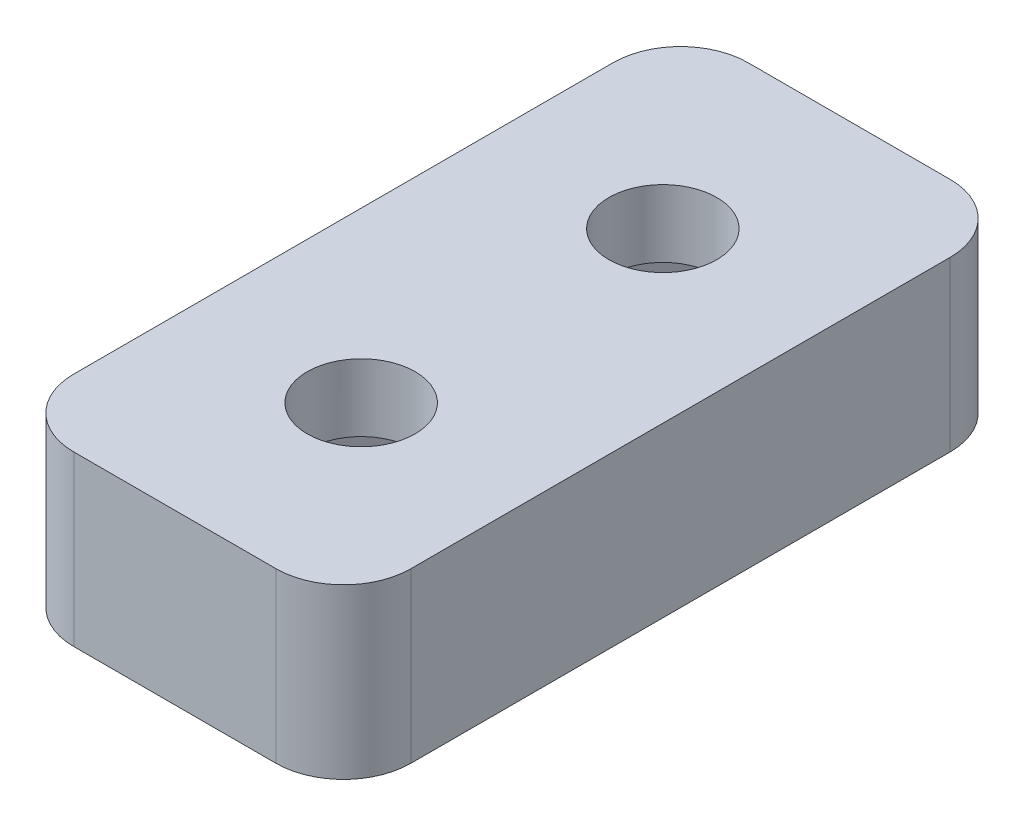
ISO-10303-21;
HEADER;
FILE_DESCRIPTION(('STEP AP214'),'2;1');
FILE_NAME('part.step','',(''),(''),'','','');
FILE_SCHEMA(('AUTOMOTIVE_DESIGN { 1 0 10303 214 1 1 1 1 }'));
ENDSEC;
DATA;
#1=APPLICATION_CONTEXT('core data for automotive mechanical design processes');
#2=APPLICATION_PROTOCOL_DEFINITION('international standard','automotive_design',2000,#1);
#3=PRODUCT_CONTEXT('',#1,'mechanical');
#4=PRODUCT('Part','Part','',(#3));
#5=PRODUCT_RELATED_PRODUCT_CATEGORY('part','',(#4));
#6=PRODUCT_DEFINITION_FORMATION('','',#4);
#7=PRODUCT_DEFINITION_CONTEXT('part definition',#1,'design');
#8=PRODUCT_DEFINITION('design','',#6,#7);
#9=PRODUCT_DEFINITION_SHAPE('','',#8);
#10=(LENGTH_UNIT() NAMED_UNIT(*) SI_UNIT(.MILLI.,.METRE.));
#11=(NAMED_UNIT(*) PLANE_ANGLE_UNIT() SI_UNIT($,.RADIAN.));
#12=(NAMED_UNIT(*) SI_UNIT($,.STERADIAN.) SOLID_ANGLE_UNIT());
#13=UNCERTAINTY_MEASURE_WITH_UNIT(LENGTH_MEASURE(1.E-05),#10,'distance_accuracy_value','');
#14=(GEOMETRIC_REPRESENTATION_CONTEXT(3) GLOBAL_UNCERTAINTY_ASSIGNED_CONTEXT((#13)) GLOBAL_UNIT_ASSIGNED_CONTEXT((#10,
#11,#12)) REPRESENTATION_CONTEXT('',''));
#15=CARTESIAN_POINT('',(0.,0.,0.));
#16=DIRECTION('',(0.,0.,1.));
#17=DIRECTION('',(1.,0.,0.));
#18=AXIS2_PLACEMENT_3D('',#15,#16,#17);
#19=CARTESIAN_POINT('',(0.,5.,4.47448218072288));
#20=DIRECTION('',(0.,-1.,0.));
#21=DIRECTION('',(0.,0.,-1.));
#22=AXIS2_PLACEMENT_3D('',#19,#20,#21);
#23=CYLINDRICAL_SURFACE('',#22,1.6);
#24=CARTESIAN_POINT('',(0.,5.,4.47448218072288));
#25=DIRECTION('',(0.,1.,0.));
#26=DIRECTION('',(0.,0.,1.));
#27=AXIS2_PLACEMENT_3D('',#24,#25,#26);
#28=CIRCLE('',#27,1.6);
#29=CARTESIAN_POINT('',(0.,5.,6.07448218072288));
#30=VERTEX_POINT('',#29);
#31=EDGE_CURVE('E278',#30,#30,#28,.T.);
#32=ORIENTED_EDGE('',*,*,#31,.T.);
#33=EDGE_LOOP('',(#32));
#34=FACE_BOUND('',#33,.T.);
#35=CARTESIAN_POINT('',(0.,3.,4.47448218072288));
#36=DIRECTION('',(0.,-1.,0.));
#37=DIRECTION('',(0.,0.,-1.));
#38=AXIS2_PLACEMENT_3D('',#35,#36,#37);
#39=CIRCLE('',#38,1.6);
#40=CARTESIAN_POINT('',(0.,3.,2.87448218072288));
#41=VERTEX_POINT('',#40);
#42=EDGE_CURVE('E223',#41,#41,#39,.T.);
#43=ORIENTED_EDGE('',*,*,#42,.T.);
#44=EDGE_LOOP('',(#43));
#45=FACE_BOUND('',#44,.T.);
#46=ADVANCED_FACE('F33',(#34,#45),#23,.F.);
#47=CARTESIAN_POINT('',(0.,5.,0.));
#48=DIRECTION('',(0.,-1.,0.));
#49=DIRECTION('',(0.,0.,-1.));
#50=AXIS2_PLACEMENT_3D('',#47,#48,#49);
#51=PLANE('',#50);
#52=DIRECTION('',(0.,0.,1.));
#53=VECTOR('',#52,1.);
#54=CARTESIAN_POINT('',(-5.,5.,10.));
#55=LINE('',#54,#53);
#56=CARTESIAN_POINT('',(-5.,5.,-8.));
#57=VERTEX_POINT('',#56);
#58=CARTESIAN_POINT('',(-5.,5.,8.));
#59=VERTEX_POINT('',#58);
#60=EDGE_CURVE('E291',#57,#59,#55,.T.);
#61=ORIENTED_EDGE('',*,*,#60,.T.);
#62=CARTESIAN_POINT('',(-3.,5.,8.));
#63=DIRECTION('',(0.,-1.,0.));
#64=DIRECTION('',(0.,0.,-1.));
#65=AXIS2_PLACEMENT_3D('',#62,#63,#64);
#66=CIRCLE('',#65,2.);
#67=CARTESIAN_POINT('',(-3.,5.,10.));
#68=VERTEX_POINT('',#67);
#69=EDGE_CURVE('E333',#59,#68,#66,.F.);
#70=ORIENTED_EDGE('',*,*,#69,.T.);
#71=DIRECTION('',(1.,0.,0.));
#72=VECTOR('',#71,1.);
#73=CARTESIAN_POINT('',(-5.,5.,10.));
#74=LINE('',#73,#72);
#75=CARTESIAN_POINT('',(3.,5.,10.));
#76=VERTEX_POINT('',#75);
#77=EDGE_CURVE('E294',#68,#76,#74,.T.);
#78=ORIENTED_EDGE('',*,*,#77,.T.);
#79=CARTESIAN_POINT('',(3.,5.,8.));
#80=DIRECTION('',(0.,-1.,0.));
#81=DIRECTION('',(0.,0.,-1.));
#82=AXIS2_PLACEMENT_3D('',#79,#80,#81);
#83=CIRCLE('',#82,2.);
#84=CARTESIAN_POINT('',(5.,5.,8.));
#85=VERTEX_POINT('',#84);
#86=EDGE_CURVE('E331',#76,#85,#83,.F.);
#87=ORIENTED_EDGE('',*,*,#86,.T.);
#88=DIRECTION('',(0.,0.,-1.));
#89=VECTOR('',#88,1.);
#90=CARTESIAN_POINT('',(5.,5.,10.));
#91=LINE('',#90,#89);
#92=CARTESIAN_POINT('',(5.,5.,-8.));
#93=VERTEX_POINT('',#92);
#94=EDGE_CURVE('E286',#85,#93,#91,.T.);
#95=ORIENTED_EDGE('',*,*,#94,.T.);
#96=CARTESIAN_POINT('',(3.,5.,-8.));
#97=DIRECTION('',(0.,-1.,0.));
#98=DIRECTION('',(0.,0.,-1.));
#99=AXIS2_PLACEMENT_3D('',#96,#97,#98);
#100=CIRCLE('',#99,2.);
#101=CARTESIAN_POINT('',(3.,5.,-10.));
#102=VERTEX_POINT('',#101);
#103=EDGE_CURVE('E54',#93,#102,#100,.F.);
#104=ORIENTED_EDGE('',*,*,#103,.T.);
#105=DIRECTION('',(-1.,0.,0.));
#106=VECTOR('',#105,1.);
#107=CARTESIAN_POINT('',(-5.,5.,-10.));
#108=LINE('',#107,#106);
#109=CARTESIAN_POINT('',(-3.,5.,-10.));
#110=VERTEX_POINT('',#109);
#111=EDGE_CURVE('E288',#102,#110,#108,.T.);
#112=ORIENTED_EDGE('',*,*,#111,.T.);
#113=CARTESIAN_POINT('',(-3.,5.,-8.));
#114=DIRECTION('',(0.,-1.,0.));
#115=DIRECTION('',(0.,0.,-1.));
#116=AXIS2_PLACEMENT_3D('',#113,#114,#115);
#117=CIRCLE('',#116,2.);
#118=EDGE_CURVE('E328',#110,#57,#117,.F.);
#119=ORIENTED_EDGE('',*,*,#118,.T.);
#120=EDGE_LOOP('',(#61,#70,#78,#87,#95,#104,#112,#119));
#121=FACE_BOUND('',#120,.T.);
#122=CARTESIAN_POINT('',(0.,5.,-4.47448218072288));
#123=DIRECTION('',(0.,1.,0.));
#124=DIRECTION('',(0.,0.,1.));
#125=AXIS2_PLACEMENT_3D('',#122,#123,#124);
#126=CIRCLE('',#125,1.6);
#127=CARTESIAN_POINT('',(0.,5.,-2.87448218072288));
#128=VERTEX_POINT('',#127);
#129=EDGE_CURVE('E281',#128,#128,#126,.T.);
#130=ORIENTED_EDGE('',*,*,#129,.F.);
#131=EDGE_LOOP('',(#130));
#132=FACE_BOUND('',#131,.T.);
#133=ORIENTED_EDGE('',*,*,#31,.F.);
#134=EDGE_LOOP('',(#133));
#135=FACE_BOUND('',#134,.T.);
#136=ADVANCED_FACE('F356',(#121,#132,#135),#51,.F.);
#137=CARTESIAN_POINT('',(0.,0.,0.));
#138=DIRECTION('',(0.,-1.,0.));
#139=DIRECTION('',(0.,0.,-1.));
#140=AXIS2_PLACEMENT_3D('',#137,#138,#139);
#141=PLANE('',#140);
#142=DIRECTION('',(0.5,0.,0.866025403784439));
#143=VECTOR('',#142,1.);
#144=CARTESIAN_POINT('',(1.61658075373095,0.,1.67448218072288));
#145=LINE('',#144,#143);
#146=CARTESIAN_POINT('',(1.61658075373095,0.,1.67448218072288));
#147=VERTEX_POINT('',#146);
#148=CARTESIAN_POINT('',(3.23316150746191,0.,4.47448218072288));
#149=VERTEX_POINT('',#148);
#150=EDGE_CURVE('E178',#147,#149,#145,.T.);
#151=ORIENTED_EDGE('',*,*,#150,.F.);
#152=DIRECTION('',(1.,0.,0.));
#153=VECTOR('',#152,1.);
#154=CARTESIAN_POINT('',(-1.61658075373095,0.,1.67448218072288));
#155=LINE('',#154,#153);
#156=CARTESIAN_POINT('',(-1.61658075373095,0.,1.67448218072288));
#157=VERTEX_POINT('',#156);
#158=EDGE_CURVE('E196',#157,#147,#155,.T.);
#159=ORIENTED_EDGE('',*,*,#158,.F.);
#160=DIRECTION('',(0.5,0.,-0.866025403784439));
#161=VECTOR('',#160,1.);
#162=CARTESIAN_POINT('',(-3.2331615074619,0.,4.47448218072288));
#163=LINE('',#162,#161);
#164=CARTESIAN_POINT('',(-3.2331615074619,0.,4.47448218072288));
#165=VERTEX_POINT('',#164);
#166=EDGE_CURVE('E199',#165,#157,#163,.T.);
#167=ORIENTED_EDGE('',*,*,#166,.F.);
#168=DIRECTION('',(-0.5,0.,-0.866025403784439));
#169=VECTOR('',#168,1.);
#170=CARTESIAN_POINT('',(-1.61658075373095,0.,7.27448218072289));
#171=LINE('',#170,#169);
#172=CARTESIAN_POINT('',(-1.61658075373095,0.,7.27448218072289));
#173=VERTEX_POINT('',#172);
#174=EDGE_CURVE('E216',#173,#165,#171,.T.);
#175=ORIENTED_EDGE('',*,*,#174,.F.);
#176=DIRECTION('',(-1.,0.,0.));
#177=VECTOR('',#176,1.);
#178=CARTESIAN_POINT('',(1.61658075373095,0.,7.27448218072289));
#179=LINE('',#178,#177);
#180=CARTESIAN_POINT('',(1.61658075373095,0.,7.27448218072289));
#181=VERTEX_POINT('',#180);
#182=EDGE_CURVE('E213',#181,#173,#179,.T.);
#183=ORIENTED_EDGE('',*,*,#182,.F.);
#184=DIRECTION('',(-0.5,0.,0.866025403784439));
#185=VECTOR('',#184,1.);
#186=CARTESIAN_POINT('',(3.23316150746191,0.,4.47448218072288));
#187=LINE('',#186,#185);
#188=EDGE_CURVE('E210',#149,#181,#187,.T.);
#189=ORIENTED_EDGE('',*,*,#188,.F.);
#190=EDGE_LOOP('',(#151,#159,#167,#175,#183,#189));
#191=FACE_BOUND('',#190,.T.);
#192=DIRECTION('',(-1.,0.,0.));
#193=VECTOR('',#192,1.);
#194=CARTESIAN_POINT('',(-1.61658075373095,0.,-1.67448218072288));
#195=LINE('',#194,#193);
#196=CARTESIAN_POINT('',(1.61658075373095,0.,-1.67448218072288));
#197=VERTEX_POINT('',#196);
#198=CARTESIAN_POINT('',(-1.61658075373095,0.,-1.67448218072288));
#199=VERTEX_POINT('',#198);
#200=EDGE_CURVE('E251',#197,#199,#195,.T.);
#201=ORIENTED_EDGE('',*,*,#200,.F.);
#202=DIRECTION('',(-0.5,0.,0.866025403784439));
#203=VECTOR('',#202,1.);
#204=CARTESIAN_POINT('',(1.61658075373095,0.,-1.67448218072288));
#205=LINE('',#204,#203);
#206=CARTESIAN_POINT('',(3.23316150746191,0.,-4.47448218072288));
#207=VERTEX_POINT('',#206);
#208=EDGE_CURVE('E235',#207,#197,#205,.T.);
#209=ORIENTED_EDGE('',*,*,#208,.F.);
#210=DIRECTION('',(0.5,0.,0.866025403784439));
#211=VECTOR('',#210,1.);
#212=CARTESIAN_POINT('',(3.23316150746191,0.,-4.47448218072288));
#213=LINE('',#212,#211);
#214=CARTESIAN_POINT('',(1.61658075373095,0.,-7.27448218072289));
#215=VERTEX_POINT('',#214);
#216=EDGE_CURVE('E262',#215,#207,#213,.T.);
#217=ORIENTED_EDGE('',*,*,#216,.F.);
#218=DIRECTION('',(1.,0.,0.));
#219=VECTOR('',#218,1.);
#220=CARTESIAN_POINT('',(1.61658075373095,0.,-7.27448218072289));
#221=LINE('',#220,#219);
#222=CARTESIAN_POINT('',(-1.61658075373095,0.,-7.27448218072289));
#223=VERTEX_POINT('',#222);
#224=EDGE_CURVE('E259',#223,#215,#221,.T.);
#225=ORIENTED_EDGE('',*,*,#224,.F.);
#226=DIRECTION('',(0.5,0.,-0.866025403784439));
#227=VECTOR('',#226,1.);
#228=CARTESIAN_POINT('',(-1.61658075373095,0.,-7.27448218072289));
#229=LINE('',#228,#227);
#230=CARTESIAN_POINT('',(-3.2331615074619,0.,-4.47448218072288));
#231=VERTEX_POINT('',#230);
#232=EDGE_CURVE('E256',#231,#223,#229,.T.);
#233=ORIENTED_EDGE('',*,*,#232,.F.);
#234=DIRECTION('',(-0.5,0.,-0.866025403784439));
#235=VECTOR('',#234,1.);
#236=CARTESIAN_POINT('',(-3.2331615074619,0.,-4.47448218072288));
#237=LINE('',#236,#235);
#238=EDGE_CURVE('E253',#199,#231,#237,.T.);
#239=ORIENTED_EDGE('',*,*,#238,.F.);
#240=EDGE_LOOP('',(#201,#209,#217,#225,#233,#239));
#241=FACE_BOUND('',#240,.T.);
#242=DIRECTION('',(1.,0.,0.));
#243=VECTOR('',#242,1.);
#244=CARTESIAN_POINT('',(-5.,0.,10.));
#245=LINE('',#244,#243);
#246=CARTESIAN_POINT('',(-3.,0.,10.));
#247=VERTEX_POINT('',#246);
#248=CARTESIAN_POINT('',(3.,0.,10.));
#249=VERTEX_POINT('',#248);
#250=EDGE_CURVE('E289',#247,#249,#245,.T.);
#251=ORIENTED_EDGE('',*,*,#250,.F.);
#252=CARTESIAN_POINT('',(-3.,0.,8.));
#253=DIRECTION('',(0.,-1.,0.));
#254=DIRECTION('',(0.,0.,-1.));
#255=AXIS2_PLACEMENT_3D('',#252,#253,#254);
#256=CIRCLE('',#255,2.);
#257=CARTESIAN_POINT('',(-5.,0.,8.));
#258=VERTEX_POINT('',#257);
#259=EDGE_CURVE('E321',#247,#258,#256,.T.);
#260=ORIENTED_EDGE('',*,*,#259,.T.);
#261=DIRECTION('',(0.,0.,1.));
#262=VECTOR('',#261,1.);
#263=CARTESIAN_POINT('',(-5.,0.,10.));
#264=LINE('',#263,#262);
#265=CARTESIAN_POINT('',(-5.,0.,-8.));
#266=VERTEX_POINT('',#265);
#267=EDGE_CURVE('E302',#266,#258,#264,.T.);
#268=ORIENTED_EDGE('',*,*,#267,.F.);
#269=CARTESIAN_POINT('',(-3.,0.,-8.));
#270=DIRECTION('',(0.,-1.,0.));
#271=DIRECTION('',(0.,0.,-1.));
#272=AXIS2_PLACEMENT_3D('',#269,#270,#271);
#273=CIRCLE('',#272,2.);
#274=CARTESIAN_POINT('',(-3.,0.,-10.));
#275=VERTEX_POINT('',#274);
#276=EDGE_CURVE('E315',#266,#275,#273,.T.);
#277=ORIENTED_EDGE('',*,*,#276,.T.);
#278=DIRECTION('',(-1.,0.,0.));
#279=VECTOR('',#278,1.);
#280=CARTESIAN_POINT('',(-5.,0.,-10.));
#281=LINE('',#280,#279);
#282=CARTESIAN_POINT('',(3.,0.,-10.));
#283=VERTEX_POINT('',#282);
#284=EDGE_CURVE('E300',#283,#275,#281,.T.);
#285=ORIENTED_EDGE('',*,*,#284,.F.);
#286=CARTESIAN_POINT('',(3.,0.,-8.));
#287=DIRECTION('',(0.,-1.,0.));
#288=DIRECTION('',(0.,0.,-1.));
#289=AXIS2_PLACEMENT_3D('',#286,#287,#288);
#290=CIRCLE('',#289,2.);
#291=CARTESIAN_POINT('',(5.,0.,-8.));
#292=VERTEX_POINT('',#291);
#293=EDGE_CURVE('E317',#283,#292,#290,.T.);
#294=ORIENTED_EDGE('',*,*,#293,.T.);
#295=DIRECTION('',(0.,0.,-1.));
#296=VECTOR('',#295,1.);
#297=CARTESIAN_POINT('',(5.,0.,10.));
#298=LINE('',#297,#296);
#299=CARTESIAN_POINT('',(5.,0.,8.));
#300=VERTEX_POINT('',#299);
#301=EDGE_CURVE('E285',#300,#292,#298,.T.);
#302=ORIENTED_EDGE('',*,*,#301,.F.);
#303=CARTESIAN_POINT('',(3.,0.,8.));
#304=DIRECTION('',(0.,-1.,0.));
#305=DIRECTION('',(0.,0.,-1.));
#306=AXIS2_PLACEMENT_3D('',#303,#304,#305);
#307=CIRCLE('',#306,2.);
#308=EDGE_CURVE('E319',#300,#249,#307,.T.);
#309=ORIENTED_EDGE('',*,*,#308,.T.);
#310=EDGE_LOOP('',(#251,#260,#268,#277,#285,#294,#302,#309));
#311=FACE_BOUND('',#310,.T.);
#312=ADVANCED_FACE('F349',(#191,#241,#311),#141,.T.);
#313=CARTESIAN_POINT('',(5.,5.,10.));
#314=DIRECTION('',(-1.,0.,0.));
#315=DIRECTION('',(0.,0.,1.));
#316=AXIS2_PLACEMENT_3D('',#313,#314,#315);
#317=PLANE('',#316);
#318=ORIENTED_EDGE('',*,*,#94,.F.);
#319=DIRECTION('',(0.,-1.,0.));
#320=VECTOR('',#319,1.);
#321=CARTESIAN_POINT('',(5.,5.,8.));
#322=LINE('',#321,#320);
#323=EDGE_CURVE('E337',#85,#300,#322,.T.);
#324=ORIENTED_EDGE('',*,*,#323,.T.);
#325=ORIENTED_EDGE('',*,*,#301,.T.);
#326=DIRECTION('',(0.,-1.,0.));
#327=VECTOR('',#326,1.);
#328=CARTESIAN_POINT('',(5.,5.,-8.));
#329=LINE('',#328,#327);
#330=EDGE_CURVE('E335',#292,#93,#329,.F.);
#331=ORIENTED_EDGE('',*,*,#330,.T.);
#332=EDGE_LOOP('',(#318,#324,#325,#331));
#333=FACE_BOUND('',#332,.T.);
#334=ADVANCED_FACE('F343',(#333),#317,.F.);
#335=CARTESIAN_POINT('',(-5.,5.,-10.));
#336=DIRECTION('',(0.,0.,1.));
#337=DIRECTION('',(1.,0.,0.));
#338=AXIS2_PLACEMENT_3D('',#335,#336,#337);
#339=PLANE('',#338);
#340=ORIENTED_EDGE('',*,*,#111,.F.);
#341=DIRECTION('',(0.,-1.,0.));
#342=VECTOR('',#341,1.);
#343=CARTESIAN_POINT('',(3.,5.,-10.));
#344=LINE('',#343,#342);
#345=EDGE_CURVE('E11',#102,#283,#344,.T.);
#346=ORIENTED_EDGE('',*,*,#345,.T.);
#347=ORIENTED_EDGE('',*,*,#284,.T.);
#348=DIRECTION('',(0.,-1.,0.));
#349=VECTOR('',#348,1.);
#350=CARTESIAN_POINT('',(-3.,5.,-10.));
#351=LINE('',#350,#349);
#352=EDGE_CURVE('E41',#275,#110,#351,.F.);
#353=ORIENTED_EDGE('',*,*,#352,.T.);
#354=EDGE_LOOP('',(#340,#346,#347,#353));
#355=FACE_BOUND('',#354,.T.);
#356=ADVANCED_FACE('F354',(#355),#339,.F.);
#357=CARTESIAN_POINT('',(-5.,5.,10.));
#358=DIRECTION('',(1.,0.,0.));
#359=DIRECTION('',(0.,0.,-1.));
#360=AXIS2_PLACEMENT_3D('',#357,#358,#359);
#361=PLANE('',#360);
#362=ORIENTED_EDGE('',*,*,#267,.T.);
#363=DIRECTION('',(0.,-1.,0.));
#364=VECTOR('',#363,1.);
#365=CARTESIAN_POINT('',(-5.,5.,8.));
#366=LINE('',#365,#364);
#367=EDGE_CURVE('E326',#258,#59,#366,.F.);
#368=ORIENTED_EDGE('',*,*,#367,.T.);
#369=ORIENTED_EDGE('',*,*,#60,.F.);
#370=DIRECTION('',(0.,-1.,0.));
#371=VECTOR('',#370,1.);
#372=CARTESIAN_POINT('',(-5.,5.,-8.));
#373=LINE('',#372,#371);
#374=EDGE_CURVE('E323',#57,#266,#373,.T.);
#375=ORIENTED_EDGE('',*,*,#374,.T.);
#376=EDGE_LOOP('',(#362,#368,#369,#375));
#377=FACE_BOUND('',#376,.T.);
#378=ADVANCED_FACE('F363',(#377),#361,.F.);
#379=CARTESIAN_POINT('',(-5.,5.,10.));
#380=DIRECTION('',(0.,0.,-1.));
#381=DIRECTION('',(-1.,0.,0.));
#382=AXIS2_PLACEMENT_3D('',#379,#380,#381);
#383=PLANE('',#382);
#384=ORIENTED_EDGE('',*,*,#77,.F.);
#385=DIRECTION('',(0.,-1.,0.));
#386=VECTOR('',#385,1.);
#387=CARTESIAN_POINT('',(-3.,5.,10.));
#388=LINE('',#387,#386);
#389=EDGE_CURVE('E312',#68,#247,#388,.T.);
#390=ORIENTED_EDGE('',*,*,#389,.T.);
#391=ORIENTED_EDGE('',*,*,#250,.T.);
#392=DIRECTION('',(0.,-1.,0.));
#393=VECTOR('',#392,1.);
#394=CARTESIAN_POINT('',(3.,5.,10.));
#395=LINE('',#394,#393);
#396=EDGE_CURVE('E297',#249,#76,#395,.F.);
#397=ORIENTED_EDGE('',*,*,#396,.T.);
#398=EDGE_LOOP('',(#384,#390,#391,#397));
#399=FACE_BOUND('',#398,.T.);
#400=ADVANCED_FACE('F371',(#399),#383,.F.);
#401=CARTESIAN_POINT('',(0.,5.,-4.47448218072288));
#402=DIRECTION('',(0.,-1.,0.));
#403=DIRECTION('',(0.,0.,-1.));
#404=AXIS2_PLACEMENT_3D('',#401,#402,#403);
#405=CYLINDRICAL_SURFACE('',#404,1.6);
#406=CARTESIAN_POINT('',(0.,3.,-4.47448218072288));
#407=DIRECTION('',(0.,1.,0.));
#408=DIRECTION('',(0.,0.,1.));
#409=AXIS2_PLACEMENT_3D('',#406,#407,#408);
#410=CIRCLE('',#409,1.6);
#411=CARTESIAN_POINT('',(0.,3.,-2.87448218072288));
#412=VERTEX_POINT('',#411);
#413=EDGE_CURVE('E282',#412,#412,#410,.T.);
#414=ORIENTED_EDGE('',*,*,#413,.F.);
#415=EDGE_LOOP('',(#414));
#416=FACE_BOUND('',#415,.T.);
#417=ORIENTED_EDGE('',*,*,#129,.T.);
#418=EDGE_LOOP('',(#417));
#419=FACE_BOUND('',#418,.T.);
#420=ADVANCED_FACE('F394',(#416,#419),#405,.F.);
#421=CARTESIAN_POINT('',(1.61658075373095,3.,1.67448218072288));
#422=DIRECTION('',(0.866025403784439,0.,-0.5));
#423=DIRECTION('',(-0.5,0.,-0.866025403784439));
#424=AXIS2_PLACEMENT_3D('',#421,#422,#423);
#425=PLANE('',#424);
#426=ORIENTED_EDGE('',*,*,#150,.T.);
#427=DIRECTION('',(0.,-1.,0.));
#428=VECTOR('',#427,1.);
#429=CARTESIAN_POINT('',(3.23316150746191,3.,4.47448218072288));
#430=LINE('',#429,#428);
#431=CARTESIAN_POINT('',(3.23316150746191,3.,4.47448218072288));
#432=VERTEX_POINT('',#431);
#433=EDGE_CURVE('E171',#432,#149,#430,.T.);
#434=ORIENTED_EDGE('',*,*,#433,.F.);
#435=DIRECTION('',(0.5,0.,0.866025403784439));
#436=VECTOR('',#435,1.);
#437=CARTESIAN_POINT('',(1.61658075373095,3.,1.67448218072288));
#438=LINE('',#437,#436);
#439=CARTESIAN_POINT('',(1.61658075373095,3.,1.67448218072288));
#440=VERTEX_POINT('',#439);
#441=EDGE_CURVE('E175',#440,#432,#438,.T.);
#442=ORIENTED_EDGE('',*,*,#441,.F.);
#443=DIRECTION('',(0.,-1.,0.));
#444=VECTOR('',#443,1.);
#445=CARTESIAN_POINT('',(1.61658075373095,3.,1.67448218072288));
#446=LINE('',#445,#444);
#447=EDGE_CURVE('E221',#440,#147,#446,.T.);
#448=ORIENTED_EDGE('',*,*,#447,.T.);
#449=EDGE_LOOP('',(#426,#434,#442,#448));
#450=FACE_BOUND('',#449,.T.);
#451=ADVANCED_FACE('F173',(#450),#425,.F.);
#452=CARTESIAN_POINT('',(-1.61658075373095,3.,1.67448218072288));
#453=DIRECTION('',(0.,0.,-1.));
#454=DIRECTION('',(-1.,0.,0.));
#455=AXIS2_PLACEMENT_3D('',#452,#453,#454);
#456=PLANE('',#455);
#457=ORIENTED_EDGE('',*,*,#158,.T.);
#458=ORIENTED_EDGE('',*,*,#447,.F.);
#459=DIRECTION('',(1.,0.,0.));
#460=VECTOR('',#459,1.);
#461=CARTESIAN_POINT('',(-1.61658075373095,3.,1.67448218072288));
#462=LINE('',#461,#460);
#463=CARTESIAN_POINT('',(-1.61658075373095,3.,1.67448218072288));
#464=VERTEX_POINT('',#463);
#465=EDGE_CURVE('E183',#464,#440,#462,.T.);
#466=ORIENTED_EDGE('',*,*,#465,.F.);
#467=DIRECTION('',(0.,-1.,0.));
#468=VECTOR('',#467,1.);
#469=CARTESIAN_POINT('',(-1.61658075373095,3.,1.67448218072288));
#470=LINE('',#469,#468);
#471=EDGE_CURVE('E224',#464,#157,#470,.T.);
#472=ORIENTED_EDGE('',*,*,#471,.T.);
#473=EDGE_LOOP('',(#457,#458,#466,#472));
#474=FACE_BOUND('',#473,.T.);
#475=ADVANCED_FACE('F435',(#474),#456,.F.);
#476=CARTESIAN_POINT('',(-3.2331615074619,3.,4.47448218072288));
#477=DIRECTION('',(-0.866025403784439,0.,-0.5));
#478=DIRECTION('',(-0.5,0.,0.866025403784439));
#479=AXIS2_PLACEMENT_3D('',#476,#477,#478);
#480=PLANE('',#479);
#481=ORIENTED_EDGE('',*,*,#166,.T.);
#482=ORIENTED_EDGE('',*,*,#471,.F.);
#483=DIRECTION('',(0.5,0.,-0.866025403784439));
#484=VECTOR('',#483,1.);
#485=CARTESIAN_POINT('',(-3.2331615074619,3.,4.47448218072288));
#486=LINE('',#485,#484);
#487=CARTESIAN_POINT('',(-3.2331615074619,3.,4.47448218072288));
#488=VERTEX_POINT('',#487);
#489=EDGE_CURVE('E206',#488,#464,#486,.T.);
#490=ORIENTED_EDGE('',*,*,#489,.F.);
#491=DIRECTION('',(0.,-1.,0.));
#492=VECTOR('',#491,1.);
#493=CARTESIAN_POINT('',(-3.2331615074619,3.,4.47448218072288));
#494=LINE('',#493,#492);
#495=EDGE_CURVE('E226',#488,#165,#494,.T.);
#496=ORIENTED_EDGE('',*,*,#495,.T.);
#497=EDGE_LOOP('',(#481,#482,#490,#496));
#498=FACE_BOUND('',#497,.T.);
#499=ADVANCED_FACE('F442',(#498),#480,.F.);
#500=CARTESIAN_POINT('',(-1.61658075373095,3.,7.27448218072289));
#501=DIRECTION('',(-0.866025403784439,0.,0.5));
#502=DIRECTION('',(0.5,0.,0.866025403784439));
#503=AXIS2_PLACEMENT_3D('',#500,#501,#502);
#504=PLANE('',#503);
#505=ORIENTED_EDGE('',*,*,#174,.T.);
#506=ORIENTED_EDGE('',*,*,#495,.F.);
#507=DIRECTION('',(-0.5,0.,-0.866025403784439));
#508=VECTOR('',#507,1.);
#509=CARTESIAN_POINT('',(-1.61658075373095,3.,7.27448218072289));
#510=LINE('',#509,#508);
#511=CARTESIAN_POINT('',(-1.61658075373095,3.,7.27448218072289));
#512=VERTEX_POINT('',#511);
#513=EDGE_CURVE('E203',#512,#488,#510,.T.);
#514=ORIENTED_EDGE('',*,*,#513,.F.);
#515=DIRECTION('',(0.,-1.,0.));
#516=VECTOR('',#515,1.);
#517=CARTESIAN_POINT('',(-1.61658075373095,3.,7.27448218072289));
#518=LINE('',#517,#516);
#519=EDGE_CURVE('E228',#512,#173,#518,.T.);
#520=ORIENTED_EDGE('',*,*,#519,.T.);
#521=EDGE_LOOP('',(#505,#506,#514,#520));
#522=FACE_BOUND('',#521,.T.);
#523=ADVANCED_FACE('F450',(#522),#504,.F.);
#524=CARTESIAN_POINT('',(1.61658075373095,3.,7.27448218072289));
#525=DIRECTION('',(0.,0.,1.));
#526=DIRECTION('',(1.,0.,0.));
#527=AXIS2_PLACEMENT_3D('',#524,#525,#526);
#528=PLANE('',#527);
#529=ORIENTED_EDGE('',*,*,#182,.T.);
#530=ORIENTED_EDGE('',*,*,#519,.F.);
#531=DIRECTION('',(-1.,0.,0.));
#532=VECTOR('',#531,1.);
#533=CARTESIAN_POINT('',(1.61658075373095,3.,7.27448218072289));
#534=LINE('',#533,#532);
#535=CARTESIAN_POINT('',(1.61658075373095,3.,7.27448218072289));
#536=VERTEX_POINT('',#535);
#537=EDGE_CURVE('E191',#536,#512,#534,.T.);
#538=ORIENTED_EDGE('',*,*,#537,.F.);
#539=DIRECTION('',(0.,-1.,0.));
#540=VECTOR('',#539,1.);
#541=CARTESIAN_POINT('',(1.61658075373095,3.,7.27448218072289));
#542=LINE('',#541,#540);
#543=EDGE_CURVE('E182',#536,#181,#542,.T.);
#544=ORIENTED_EDGE('',*,*,#543,.T.);
#545=EDGE_LOOP('',(#529,#530,#538,#544));
#546=FACE_BOUND('',#545,.T.);
#547=ADVANCED_FACE('F458',(#546),#528,.F.);
#548=CARTESIAN_POINT('',(3.23316150746191,3.,4.47448218072288));
#549=DIRECTION('',(0.866025403784439,0.,0.5));
#550=DIRECTION('',(0.5,0.,-0.866025403784439));
#551=AXIS2_PLACEMENT_3D('',#548,#549,#550);
#552=PLANE('',#551);
#553=ORIENTED_EDGE('',*,*,#188,.T.);
#554=ORIENTED_EDGE('',*,*,#543,.F.);
#555=DIRECTION('',(-0.5,0.,0.866025403784439));
#556=VECTOR('',#555,1.);
#557=CARTESIAN_POINT('',(3.23316150746191,3.,4.47448218072288));
#558=LINE('',#557,#556);
#559=EDGE_CURVE('E186',#432,#536,#558,.T.);
#560=ORIENTED_EDGE('',*,*,#559,.F.);
#561=ORIENTED_EDGE('',*,*,#433,.T.);
#562=EDGE_LOOP('',(#553,#554,#560,#561));
#563=FACE_BOUND('',#562,.T.);
#564=ADVANCED_FACE('F187',(#563),#552,.F.);
#565=CARTESIAN_POINT('',(0.,3.,0.));
#566=DIRECTION('',(0.,-1.,0.));
#567=DIRECTION('',(0.,0.,-1.));
#568=AXIS2_PLACEMENT_3D('',#565,#566,#567);
#569=PLANE('',#568);
#570=ORIENTED_EDGE('',*,*,#42,.F.);
#571=EDGE_LOOP('',(#570));
#572=FACE_BOUND('',#571,.T.);
#573=ORIENTED_EDGE('',*,*,#441,.T.);
#574=ORIENTED_EDGE('',*,*,#559,.T.);
#575=ORIENTED_EDGE('',*,*,#537,.T.);
#576=ORIENTED_EDGE('',*,*,#513,.T.);
#577=ORIENTED_EDGE('',*,*,#489,.T.);
#578=ORIENTED_EDGE('',*,*,#465,.T.);
#579=EDGE_LOOP('',(#573,#574,#575,#576,#577,#578));
#580=FACE_BOUND('',#579,.T.);
#581=ADVANCED_FACE('F193',(#572,#580),#569,.T.);
#582=CARTESIAN_POINT('',(-1.61658075373095,3.,-1.67448218072288));
#583=DIRECTION('',(0.,0.,1.));
#584=DIRECTION('',(1.,0.,0.));
#585=AXIS2_PLACEMENT_3D('',#582,#583,#584);
#586=PLANE('',#585);
#587=ORIENTED_EDGE('',*,*,#200,.T.);
#588=DIRECTION('',(0.,-1.,0.));
#589=VECTOR('',#588,1.);
#590=CARTESIAN_POINT('',(-1.61658075373095,3.,-1.67448218072288));
#591=LINE('',#590,#589);
#592=CARTESIAN_POINT('',(-1.61658075373095,3.,-1.67448218072288));
#593=VERTEX_POINT('',#592);
#594=EDGE_CURVE('E250',#593,#199,#591,.T.);
#595=ORIENTED_EDGE('',*,*,#594,.F.);
#596=DIRECTION('',(-1.,0.,0.));
#597=VECTOR('',#596,1.);
#598=CARTESIAN_POINT('',(-1.61658075373095,3.,-1.67448218072288));
#599=LINE('',#598,#597);
#600=CARTESIAN_POINT('',(1.61658075373095,3.,-1.67448218072288));
#601=VERTEX_POINT('',#600);
#602=EDGE_CURVE('E231',#601,#593,#599,.T.);
#603=ORIENTED_EDGE('',*,*,#602,.F.);
#604=DIRECTION('',(0.,-1.,0.));
#605=VECTOR('',#604,1.);
#606=CARTESIAN_POINT('',(1.61658075373095,3.,-1.67448218072288));
#607=LINE('',#606,#605);
#608=EDGE_CURVE('E211',#601,#197,#607,.T.);
#609=ORIENTED_EDGE('',*,*,#608,.T.);
#610=EDGE_LOOP('',(#587,#595,#603,#609));
#611=FACE_BOUND('',#610,.T.);
#612=ADVANCED_FACE('F392',(#611),#586,.F.);
#613=CARTESIAN_POINT('',(1.61658075373095,3.,-1.67448218072288));
#614=DIRECTION('',(0.866025403784439,0.,0.5));
#615=DIRECTION('',(0.5,0.,-0.866025403784439));
#616=AXIS2_PLACEMENT_3D('',#613,#614,#615);
#617=PLANE('',#616);
#618=ORIENTED_EDGE('',*,*,#208,.T.);
#619=ORIENTED_EDGE('',*,*,#608,.F.);
#620=DIRECTION('',(-0.5,0.,0.866025403784439));
#621=VECTOR('',#620,1.);
#622=CARTESIAN_POINT('',(1.61658075373095,3.,-1.67448218072288));
#623=LINE('',#622,#621);
#624=CARTESIAN_POINT('',(3.23316150746191,3.,-4.47448218072288));
#625=VERTEX_POINT('',#624);
#626=EDGE_CURVE('E247',#625,#601,#623,.T.);
#627=ORIENTED_EDGE('',*,*,#626,.F.);
#628=DIRECTION('',(0.,-1.,0.));
#629=VECTOR('',#628,1.);
#630=CARTESIAN_POINT('',(3.23316150746191,3.,-4.47448218072288));
#631=LINE('',#630,#629);
#632=EDGE_CURVE('E268',#625,#207,#631,.T.);
#633=ORIENTED_EDGE('',*,*,#632,.T.);
#634=EDGE_LOOP('',(#618,#619,#627,#633));
#635=FACE_BOUND('',#634,.T.);
#636=ADVANCED_FACE('F486',(#635),#617,.F.);
#637=CARTESIAN_POINT('',(3.23316150746191,3.,-4.47448218072288));
#638=DIRECTION('',(0.866025403784439,0.,-0.5));
#639=DIRECTION('',(-0.5,0.,-0.866025403784439));
#640=AXIS2_PLACEMENT_3D('',#637,#638,#639);
#641=PLANE('',#640);
#642=ORIENTED_EDGE('',*,*,#216,.T.);
#643=ORIENTED_EDGE('',*,*,#632,.F.);
#644=DIRECTION('',(0.5,0.,0.866025403784439));
#645=VECTOR('',#644,1.);
#646=CARTESIAN_POINT('',(3.23316150746191,3.,-4.47448218072288));
#647=LINE('',#646,#645);
#648=CARTESIAN_POINT('',(1.61658075373095,3.,-7.27448218072289));
#649=VERTEX_POINT('',#648);
#650=EDGE_CURVE('E244',#649,#625,#647,.T.);
#651=ORIENTED_EDGE('',*,*,#650,.F.);
#652=DIRECTION('',(0.,-1.,0.));
#653=VECTOR('',#652,1.);
#654=CARTESIAN_POINT('',(1.61658075373095,3.,-7.27448218072289));
#655=LINE('',#654,#653);
#656=EDGE_CURVE('E270',#649,#215,#655,.T.);
#657=ORIENTED_EDGE('',*,*,#656,.T.);
#658=EDGE_LOOP('',(#642,#643,#651,#657));
#659=FACE_BOUND('',#658,.T.);
#660=ADVANCED_FACE('F493',(#659),#641,.F.);
#661=CARTESIAN_POINT('',(1.61658075373095,3.,-7.27448218072289));
#662=DIRECTION('',(0.,0.,-1.));
#663=DIRECTION('',(-1.,0.,0.));
#664=AXIS2_PLACEMENT_3D('',#661,#662,#663);
#665=PLANE('',#664);
#666=ORIENTED_EDGE('',*,*,#224,.T.);
#667=ORIENTED_EDGE('',*,*,#656,.F.);
#668=DIRECTION('',(1.,0.,0.));
#669=VECTOR('',#668,1.);
#670=CARTESIAN_POINT('',(1.61658075373095,3.,-7.27448218072289));
#671=LINE('',#670,#669);
#672=CARTESIAN_POINT('',(-1.61658075373095,3.,-7.27448218072289));
#673=VERTEX_POINT('',#672);
#674=EDGE_CURVE('E241',#673,#649,#671,.T.);
#675=ORIENTED_EDGE('',*,*,#674,.F.);
#676=DIRECTION('',(0.,-1.,0.));
#677=VECTOR('',#676,1.);
#678=CARTESIAN_POINT('',(-1.61658075373095,3.,-7.27448218072289));
#679=LINE('',#678,#677);
#680=EDGE_CURVE('E272',#673,#223,#679,.T.);
#681=ORIENTED_EDGE('',*,*,#680,.T.);
#682=EDGE_LOOP('',(#666,#667,#675,#681));
#683=FACE_BOUND('',#682,.T.);
#684=ADVANCED_FACE('F501',(#683),#665,.F.);
#685=CARTESIAN_POINT('',(-1.61658075373095,3.,-7.27448218072289));
#686=DIRECTION('',(-0.866025403784439,0.,-0.5));
#687=DIRECTION('',(-0.5,0.,0.866025403784439));
#688=AXIS2_PLACEMENT_3D('',#685,#686,#687);
#689=PLANE('',#688);
#690=ORIENTED_EDGE('',*,*,#232,.T.);
#691=ORIENTED_EDGE('',*,*,#680,.F.);
#692=DIRECTION('',(0.5,0.,-0.866025403784439));
#693=VECTOR('',#692,1.);
#694=CARTESIAN_POINT('',(-1.61658075373095,3.,-7.27448218072289));
#695=LINE('',#694,#693);
#696=CARTESIAN_POINT('',(-3.2331615074619,3.,-4.47448218072288));
#697=VERTEX_POINT('',#696);
#698=EDGE_CURVE('E238',#697,#673,#695,.T.);
#699=ORIENTED_EDGE('',*,*,#698,.F.);
#700=DIRECTION('',(0.,-1.,0.));
#701=VECTOR('',#700,1.);
#702=CARTESIAN_POINT('',(-3.2331615074619,3.,-4.47448218072288));
#703=LINE('',#702,#701);
#704=EDGE_CURVE('E274',#697,#231,#703,.T.);
#705=ORIENTED_EDGE('',*,*,#704,.T.);
#706=EDGE_LOOP('',(#690,#691,#699,#705));
#707=FACE_BOUND('',#706,.T.);
#708=ADVANCED_FACE('F509',(#707),#689,.F.);
#709=CARTESIAN_POINT('',(-3.2331615074619,3.,-4.47448218072288));
#710=DIRECTION('',(-0.866025403784439,0.,0.5));
#711=DIRECTION('',(0.5,0.,0.866025403784439));
#712=AXIS2_PLACEMENT_3D('',#709,#710,#711);
#713=PLANE('',#712);
#714=ORIENTED_EDGE('',*,*,#238,.T.);
#715=ORIENTED_EDGE('',*,*,#704,.F.);
#716=DIRECTION('',(-0.5,0.,-0.866025403784439));
#717=VECTOR('',#716,1.);
#718=CARTESIAN_POINT('',(-3.2331615074619,3.,-4.47448218072288));
#719=LINE('',#718,#717);
#720=EDGE_CURVE('E234',#593,#697,#719,.T.);
#721=ORIENTED_EDGE('',*,*,#720,.F.);
#722=ORIENTED_EDGE('',*,*,#594,.T.);
#723=EDGE_LOOP('',(#714,#715,#721,#722));
#724=FACE_BOUND('',#723,.T.);
#725=ADVANCED_FACE('F517',(#724),#713,.F.);
#726=CARTESIAN_POINT('',(0.,3.,0.));
#727=DIRECTION('',(0.,1.,0.));
#728=DIRECTION('',(0.,0.,1.));
#729=AXIS2_PLACEMENT_3D('',#726,#727,#728);
#730=PLANE('',#729);
#731=ORIENTED_EDGE('',*,*,#413,.T.);
#732=EDGE_LOOP('',(#731));
#733=FACE_BOUND('',#732,.T.);
#734=ORIENTED_EDGE('',*,*,#602,.T.);
#735=ORIENTED_EDGE('',*,*,#720,.T.);
#736=ORIENTED_EDGE('',*,*,#698,.T.);
#737=ORIENTED_EDGE('',*,*,#674,.T.);
#738=ORIENTED_EDGE('',*,*,#650,.T.);
#739=ORIENTED_EDGE('',*,*,#626,.T.);
#740=EDGE_LOOP('',(#734,#735,#736,#737,#738,#739));
#741=FACE_BOUND('',#740,.T.);
#742=ADVANCED_FACE('F380',(#733,#741),#730,.F.);
#743=CARTESIAN_POINT('',(-3.,5.,8.));
#744=DIRECTION('',(0.,-1.,0.));
#745=DIRECTION('',(0.,0.,-1.));
#746=AXIS2_PLACEMENT_3D('',#743,#744,#745);
#747=CYLINDRICAL_SURFACE('',#746,2.);
#748=ORIENTED_EDGE('',*,*,#69,.F.);
#749=ORIENTED_EDGE('',*,*,#367,.F.);
#750=ORIENTED_EDGE('',*,*,#259,.F.);
#751=ORIENTED_EDGE('',*,*,#389,.F.);
#752=EDGE_LOOP('',(#748,#749,#750,#751));
#753=FACE_BOUND('',#752,.T.);
#754=ADVANCED_FACE('F368',(#753),#747,.T.);
#755=CARTESIAN_POINT('',(3.,5.,8.));
#756=DIRECTION('',(0.,-1.,0.));
#757=DIRECTION('',(0.,0.,-1.));
#758=AXIS2_PLACEMENT_3D('',#755,#756,#757);
#759=CYLINDRICAL_SURFACE('',#758,2.);
#760=ORIENTED_EDGE('',*,*,#86,.F.);
#761=ORIENTED_EDGE('',*,*,#396,.F.);
#762=ORIENTED_EDGE('',*,*,#308,.F.);
#763=ORIENTED_EDGE('',*,*,#323,.F.);
#764=EDGE_LOOP('',(#760,#761,#762,#763));
#765=FACE_BOUND('',#764,.T.);
#766=ADVANCED_FACE('F373',(#765),#759,.T.);
#767=CARTESIAN_POINT('',(3.,5.,-8.));
#768=DIRECTION('',(0.,-1.,0.));
#769=DIRECTION('',(0.,0.,-1.));
#770=AXIS2_PLACEMENT_3D('',#767,#768,#769);
#771=CYLINDRICAL_SURFACE('',#770,2.);
#772=ORIENTED_EDGE('',*,*,#103,.F.);
#773=ORIENTED_EDGE('',*,*,#330,.F.);
#774=ORIENTED_EDGE('',*,*,#293,.F.);
#775=ORIENTED_EDGE('',*,*,#345,.F.);
#776=EDGE_LOOP('',(#772,#773,#774,#775));
#777=FACE_BOUND('',#776,.T.);
#778=ADVANCED_FACE('F353',(#777),#771,.T.);
#779=CARTESIAN_POINT('',(-3.,5.,-8.));
#780=DIRECTION('',(0.,-1.,0.));
#781=DIRECTION('',(0.,0.,-1.));
#782=AXIS2_PLACEMENT_3D('',#779,#780,#781);
#783=CYLINDRICAL_SURFACE('',#782,2.);
#784=ORIENTED_EDGE('',*,*,#118,.F.);
#785=ORIENTED_EDGE('',*,*,#352,.F.);
#786=ORIENTED_EDGE('',*,*,#276,.F.);
#787=ORIENTED_EDGE('',*,*,#374,.F.);
#788=EDGE_LOOP('',(#784,#785,#786,#787));
#789=FACE_BOUND('',#788,.T.);
#790=ADVANCED_FACE('F35',(#789),#783,.T.);
#791=CLOSED_SHELL('',(#46,#136,#312,#334,#356,#378,#400,#420,#451,#475,#499,#523,#547,#564,#581,
#612,#636,#660,#684,#708,#725,#742,#754,#766,#778,#790));
#792=MANIFOLD_SOLID_BREP('B2',#791);
#793=ADVANCED_BREP_SHAPE_REPRESENTATION('',(#18,#792),#14);
#794=SHAPE_DEFINITION_REPRESENTATION(#9,#793);
ENDSEC;
END-ISO-10303-21;
